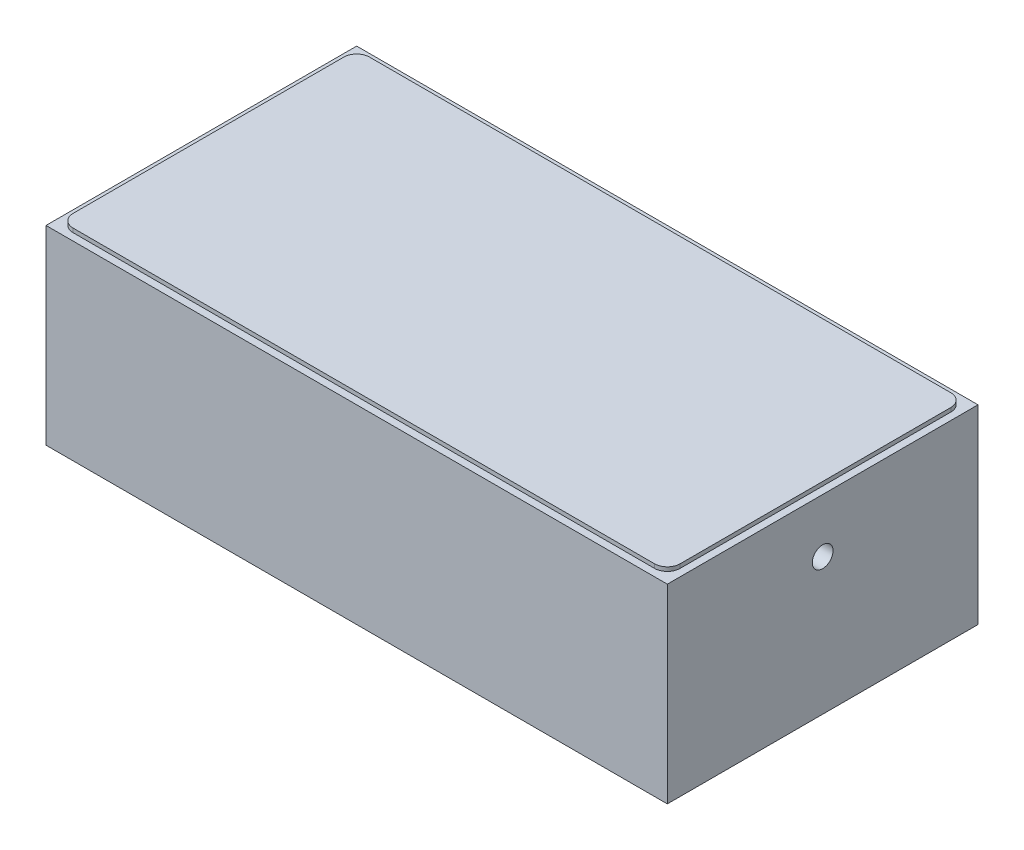
ISO-10303-21;
HEADER;
FILE_DESCRIPTION(('STEP AP214'),'2;1');
FILE_NAME('part.step','',(''),(''),'','','');
FILE_SCHEMA(('AUTOMOTIVE_DESIGN { 1 0 10303 214 1 1 1 1 }'));
ENDSEC;
DATA;
#1=APPLICATION_CONTEXT('core data for automotive mechanical design processes');
#2=APPLICATION_PROTOCOL_DEFINITION('international standard','automotive_design',2000,#1);
#3=PRODUCT_CONTEXT('',#1,'mechanical');
#4=PRODUCT('Part','Part','',(#3));
#5=PRODUCT_RELATED_PRODUCT_CATEGORY('part','',(#4));
#6=PRODUCT_DEFINITION_FORMATION('','',#4);
#7=PRODUCT_DEFINITION_CONTEXT('part definition',#1,'design');
#8=PRODUCT_DEFINITION('design','',#6,#7);
#9=PRODUCT_DEFINITION_SHAPE('','',#8);
#10=(LENGTH_UNIT() NAMED_UNIT(*) SI_UNIT(.MILLI.,.METRE.));
#11=(NAMED_UNIT(*) PLANE_ANGLE_UNIT() SI_UNIT($,.RADIAN.));
#12=(NAMED_UNIT(*) SI_UNIT($,.STERADIAN.) SOLID_ANGLE_UNIT());
#13=UNCERTAINTY_MEASURE_WITH_UNIT(LENGTH_MEASURE(1.E-05),#10,'distance_accuracy_value','');
#14=(GEOMETRIC_REPRESENTATION_CONTEXT(3) GLOBAL_UNCERTAINTY_ASSIGNED_CONTEXT((#13)) GLOBAL_UNIT_ASSIGNED_CONTEXT((#10,
#11,#12)) REPRESENTATION_CONTEXT('',''));
#15=CARTESIAN_POINT('',(0.,0.,0.));
#16=DIRECTION('',(0.,0.,1.));
#17=DIRECTION('',(1.,0.,0.));
#18=AXIS2_PLACEMENT_3D('',#15,#16,#17);
#19=CARTESIAN_POINT('',(-75.,0.,37.5));
#20=DIRECTION('',(0.,1.,0.));
#21=DIRECTION('',(0.,0.,1.));
#22=AXIS2_PLACEMENT_3D('',#19,#20,#21);
#23=PLANE('',#22);
#24=DIRECTION('',(1.,0.,0.));
#25=VECTOR('',#24,1.);
#26=CARTESIAN_POINT('',(-75.,0.,-34.452));
#27=LINE('',#26,#25);
#28=CARTESIAN_POINT('',(-71.952,0.,-34.452));
#29=VERTEX_POINT('',#28);
#30=CARTESIAN_POINT('',(71.952,0.,-34.452));
#31=VERTEX_POINT('',#30);
#32=EDGE_CURVE('E460',#29,#31,#27,.T.);
#33=ORIENTED_EDGE('',*,*,#32,.T.);
#34=DIRECTION('',(0.,0.,1.));
#35=VECTOR('',#34,1.);
#36=CARTESIAN_POINT('',(71.952,0.,37.5));
#37=LINE('',#36,#35);
#38=CARTESIAN_POINT('',(71.952,0.,34.452));
#39=VERTEX_POINT('',#38);
#40=EDGE_CURVE('E457',#31,#39,#37,.T.);
#41=ORIENTED_EDGE('',*,*,#40,.T.);
#42=DIRECTION('',(-1.,0.,0.));
#43=VECTOR('',#42,1.);
#44=CARTESIAN_POINT('',(-75.,0.,34.452));
#45=LINE('',#44,#43);
#46=CARTESIAN_POINT('',(-71.9519999999999,0.,34.452));
#47=VERTEX_POINT('',#46);
#48=EDGE_CURVE('E441',#39,#47,#45,.T.);
#49=ORIENTED_EDGE('',*,*,#48,.T.);
#50=DIRECTION('',(0.,0.,-1.));
#51=VECTOR('',#50,1.);
#52=CARTESIAN_POINT('',(-71.9519999999999,0.,37.5));
#53=LINE('',#52,#51);
#54=EDGE_CURVE('E461',#47,#29,#53,.T.);
#55=ORIENTED_EDGE('',*,*,#54,.T.);
#56=EDGE_LOOP('',(#33,#41,#49,#55));
#57=FACE_BOUND('',#56,.T.);
#58=CARTESIAN_POINT('',(-50.,0.,0.));
#59=DIRECTION('',(0.,-1.,0.));
#60=DIRECTION('',(0.,0.,-1.));
#61=AXIS2_PLACEMENT_3D('',#58,#59,#60);
#62=CIRCLE('',#61,3.175);
#63=CARTESIAN_POINT('',(-50.,0.,-3.17499999999999));
#64=VERTEX_POINT('',#63);
#65=EDGE_CURVE('E253',#64,#64,#62,.T.);
#66=ORIENTED_EDGE('',*,*,#65,.F.);
#67=EDGE_LOOP('',(#66));
#68=FACE_BOUND('',#67,.T.);
#69=CARTESIAN_POINT('',(50.,0.,0.));
#70=DIRECTION('',(0.,-1.,0.));
#71=DIRECTION('',(0.,0.,-1.));
#72=AXIS2_PLACEMENT_3D('',#69,#70,#71);
#73=CIRCLE('',#72,2.5);
#74=CARTESIAN_POINT('',(50.,0.,-2.5));
#75=VERTEX_POINT('',#74);
#76=EDGE_CURVE('E265',#75,#75,#73,.T.);
#77=ORIENTED_EDGE('',*,*,#76,.F.);
#78=EDGE_LOOP('',(#77));
#79=FACE_BOUND('',#78,.T.);
#80=CARTESIAN_POINT('',(9.52499999999985,0.,16.4977839420936));
#81=DIRECTION('',(0.,-1.,0.));
#82=DIRECTION('',(0.,0.,-1.));
#83=AXIS2_PLACEMENT_3D('',#80,#81,#82);
#84=CIRCLE('',#83,1.25);
#85=CARTESIAN_POINT('',(9.52499999999985,0.,15.2477839420936));
#86=VERTEX_POINT('',#85);
#87=EDGE_CURVE('E271',#86,#86,#84,.T.);
#88=ORIENTED_EDGE('',*,*,#87,.F.);
#89=EDGE_LOOP('',(#88));
#90=FACE_BOUND('',#89,.T.);
#91=CARTESIAN_POINT('',(9.52500000000008,0.,-16.4977839420935));
#92=DIRECTION('',(0.,-1.,0.));
#93=DIRECTION('',(0.,0.,-1.));
#94=AXIS2_PLACEMENT_3D('',#91,#92,#93);
#95=CIRCLE('',#94,1.25);
#96=CARTESIAN_POINT('',(9.52500000000008,0.,-17.7477839420935));
#97=VERTEX_POINT('',#96);
#98=EDGE_CURVE('E277',#97,#97,#95,.T.);
#99=ORIENTED_EDGE('',*,*,#98,.F.);
#100=EDGE_LOOP('',(#99));
#101=FACE_BOUND('',#100,.T.);
#102=CARTESIAN_POINT('',(-19.05,0.,0.));
#103=DIRECTION('',(0.,-1.,0.));
#104=DIRECTION('',(0.,0.,-1.));
#105=AXIS2_PLACEMENT_3D('',#102,#103,#104);
#106=CIRCLE('',#105,1.25);
#107=CARTESIAN_POINT('',(-19.05,0.,-1.25));
#108=VERTEX_POINT('',#107);
#109=EDGE_CURVE('E283',#108,#108,#106,.T.);
#110=ORIENTED_EDGE('',*,*,#109,.F.);
#111=EDGE_LOOP('',(#110));
#112=FACE_BOUND('',#111,.T.);
#113=CARTESIAN_POINT('',(0.,0.,0.));
#114=DIRECTION('',(0.,1.,0.));
#115=DIRECTION('',(0.,0.,1.));
#116=AXIS2_PLACEMENT_3D('',#113,#114,#115);
#117=CIRCLE('',#116,12.4964787936442);
#118=CARTESIAN_POINT('',(0.,0.,12.4964787936442));
#119=VERTEX_POINT('',#118);
#120=EDGE_CURVE('E286',#119,#119,#117,.F.);
#121=ORIENTED_EDGE('',*,*,#120,.F.);
#122=EDGE_LOOP('',(#121));
#123=FACE_BOUND('',#122,.T.);
#124=ADVANCED_FACE('F43',(#57,#68,#79,#90,#101,#112,#123),#23,.F.);
#125=CARTESIAN_POINT('',(-75.,48.9966,-37.5));
#126=DIRECTION('',(1.,0.,0.));
#127=DIRECTION('',(0.,0.,-1.));
#128=AXIS2_PLACEMENT_3D('',#125,#126,#127);
#129=PLANE('',#128);
#130=DIRECTION('',(0.,-1.,0.));
#131=VECTOR('',#130,1.);
#132=CARTESIAN_POINT('',(-75.,48.9966,-37.5));
#133=LINE('',#132,#131);
#134=CARTESIAN_POINT('',(-75.,48.9966,-37.5));
#135=VERTEX_POINT('',#134);
#136=CARTESIAN_POINT('',(-75.,3.04800000000001,-37.5));
#137=VERTEX_POINT('',#136);
#138=EDGE_CURVE('E296',#135,#137,#133,.T.);
#139=ORIENTED_EDGE('',*,*,#138,.T.);
#140=DIRECTION('',(0.,0.,1.));
#141=VECTOR('',#140,1.);
#142=CARTESIAN_POINT('',(-75.,3.04800000000001,-37.5));
#143=LINE('',#142,#141);
#144=CARTESIAN_POINT('',(-75.,3.04800000000001,37.5));
#145=VERTEX_POINT('',#144);
#146=EDGE_CURVE('E12',#137,#145,#143,.T.);
#147=ORIENTED_EDGE('',*,*,#146,.T.);
#148=DIRECTION('',(0.,-1.,0.));
#149=VECTOR('',#148,1.);
#150=CARTESIAN_POINT('',(-75.,48.9966,37.5));
#151=LINE('',#150,#149);
#152=CARTESIAN_POINT('',(-75.,48.9966,37.5));
#153=VERTEX_POINT('',#152);
#154=EDGE_CURVE('E305',#153,#145,#151,.T.);
#155=ORIENTED_EDGE('',*,*,#154,.F.);
#156=DIRECTION('',(0.,0.,1.));
#157=VECTOR('',#156,1.);
#158=CARTESIAN_POINT('',(-75.,48.9966,-37.5));
#159=LINE('',#158,#157);
#160=EDGE_CURVE('E287',#135,#153,#159,.T.);
#161=ORIENTED_EDGE('',*,*,#160,.F.);
#162=EDGE_LOOP('',(#139,#147,#155,#161));
#163=FACE_BOUND('',#162,.T.);
#164=ADVANCED_FACE('F400',(#163),#129,.F.);
#165=CARTESIAN_POINT('',(-75.,48.9966,37.5));
#166=DIRECTION('',(0.,0.,-1.));
#167=DIRECTION('',(-1.,0.,0.));
#168=AXIS2_PLACEMENT_3D('',#165,#166,#167);
#169=PLANE('',#168);
#170=ORIENTED_EDGE('',*,*,#154,.T.);
#171=DIRECTION('',(1.,0.,0.));
#172=VECTOR('',#171,1.);
#173=CARTESIAN_POINT('',(-75.,3.04800000000001,37.5));
#174=LINE('',#173,#172);
#175=CARTESIAN_POINT('',(75.,3.04800000000001,37.5));
#176=VERTEX_POINT('',#175);
#177=EDGE_CURVE('E443',#145,#176,#174,.T.);
#178=ORIENTED_EDGE('',*,*,#177,.T.);
#179=DIRECTION('',(0.,-1.,0.));
#180=VECTOR('',#179,1.);
#181=CARTESIAN_POINT('',(75.,48.9966,37.5));
#182=LINE('',#181,#180);
#183=CARTESIAN_POINT('',(75.,48.9966,37.5));
#184=VERTEX_POINT('',#183);
#185=EDGE_CURVE('E302',#184,#176,#182,.T.);
#186=ORIENTED_EDGE('',*,*,#185,.F.);
#187=DIRECTION('',(1.,0.,0.));
#188=VECTOR('',#187,1.);
#189=CARTESIAN_POINT('',(-75.,48.9966,37.5));
#190=LINE('',#189,#188);
#191=EDGE_CURVE('E290',#153,#184,#190,.T.);
#192=ORIENTED_EDGE('',*,*,#191,.F.);
#193=EDGE_LOOP('',(#170,#178,#186,#192));
#194=FACE_BOUND('',#193,.T.);
#195=ADVANCED_FACE('F406',(#194),#169,.F.);
#196=CARTESIAN_POINT('',(75.,48.9966,-37.5));
#197=DIRECTION('',(-1.,0.,0.));
#198=DIRECTION('',(0.,0.,1.));
#199=AXIS2_PLACEMENT_3D('',#196,#197,#198);
#200=PLANE('',#199);
#201=CARTESIAN_POINT('',(75.0000000000001,35.9918,0.));
#202=DIRECTION('',(1.,0.,0.));
#203=DIRECTION('',(0.,0.,-1.));
#204=AXIS2_PLACEMENT_3D('',#201,#202,#203);
#205=CIRCLE('',#204,2.49999999999995);
#206=CARTESIAN_POINT('',(75.0000000000001,35.9918,-2.49999999999994));
#207=VERTEX_POINT('',#206);
#208=EDGE_CURVE('E247',#207,#207,#205,.T.);
#209=ORIENTED_EDGE('',*,*,#208,.F.);
#210=EDGE_LOOP('',(#209));
#211=FACE_BOUND('',#210,.T.);
#212=ORIENTED_EDGE('',*,*,#185,.T.);
#213=DIRECTION('',(0.,0.,-1.));
#214=VECTOR('',#213,1.);
#215=CARTESIAN_POINT('',(75.,3.04800000000001,-37.5));
#216=LINE('',#215,#214);
#217=CARTESIAN_POINT('',(75.,3.04800000000001,-37.5));
#218=VERTEX_POINT('',#217);
#219=EDGE_CURVE('E308',#176,#218,#216,.T.);
#220=ORIENTED_EDGE('',*,*,#219,.T.);
#221=DIRECTION('',(0.,-1.,0.));
#222=VECTOR('',#221,1.);
#223=CARTESIAN_POINT('',(75.,48.9966,-37.5));
#224=LINE('',#223,#222);
#225=CARTESIAN_POINT('',(75.,48.9966,-37.5));
#226=VERTEX_POINT('',#225);
#227=EDGE_CURVE('E299',#226,#218,#224,.T.);
#228=ORIENTED_EDGE('',*,*,#227,.F.);
#229=DIRECTION('',(0.,0.,-1.));
#230=VECTOR('',#229,1.);
#231=CARTESIAN_POINT('',(75.,48.9966,-37.5));
#232=LINE('',#231,#230);
#233=EDGE_CURVE('E292',#184,#226,#232,.T.);
#234=ORIENTED_EDGE('',*,*,#233,.F.);
#235=EDGE_LOOP('',(#212,#220,#228,#234));
#236=FACE_BOUND('',#235,.T.);
#237=ADVANCED_FACE('F414',(#211,#236),#200,.F.);
#238=CARTESIAN_POINT('',(-75.,48.9966,-37.5));
#239=DIRECTION('',(0.,0.,1.));
#240=DIRECTION('',(1.,0.,0.));
#241=AXIS2_PLACEMENT_3D('',#238,#239,#240);
#242=PLANE('',#241);
#243=ORIENTED_EDGE('',*,*,#227,.T.);
#244=DIRECTION('',(-1.,0.,0.));
#245=VECTOR('',#244,1.);
#246=CARTESIAN_POINT('',(-75.,3.04800000000001,-37.5));
#247=LINE('',#246,#245);
#248=EDGE_CURVE('E52',#218,#137,#247,.T.);
#249=ORIENTED_EDGE('',*,*,#248,.T.);
#250=ORIENTED_EDGE('',*,*,#138,.F.);
#251=DIRECTION('',(-1.,0.,0.));
#252=VECTOR('',#251,1.);
#253=CARTESIAN_POINT('',(-75.,48.9966,-37.5));
#254=LINE('',#253,#252);
#255=EDGE_CURVE('E294',#226,#135,#254,.T.);
#256=ORIENTED_EDGE('',*,*,#255,.F.);
#257=EDGE_LOOP('',(#243,#249,#250,#256));
#258=FACE_BOUND('',#257,.T.);
#259=ADVANCED_FACE('F411',(#258),#242,.F.);
#260=CARTESIAN_POINT('',(-75.,48.9966,37.5));
#261=DIRECTION('',(0.,1.,0.));
#262=DIRECTION('',(0.,0.,1.));
#263=AXIS2_PLACEMENT_3D('',#260,#261,#262);
#264=PLANE('',#263);
#265=CARTESIAN_POINT('',(70.1613,48.9966,32.6613));
#266=DIRECTION('',(0.,-1.,0.));
#267=DIRECTION('',(0.,0.,1.));
#268=AXIS2_PLACEMENT_3D('',#265,#266,#267);
#269=CIRCLE('',#268,3.08609999999999);
#270=CARTESIAN_POINT('',(73.2474,48.9966,32.6613));
#271=VERTEX_POINT('',#270);
#272=CARTESIAN_POINT('',(70.1613,48.9966,35.7474));
#273=VERTEX_POINT('',#272);
#274=EDGE_CURVE('E205',#271,#273,#269,.T.);
#275=ORIENTED_EDGE('',*,*,#274,.T.);
#276=DIRECTION('',(-1.,0.,0.));
#277=VECTOR('',#276,1.);
#278=CARTESIAN_POINT('',(70.1613,48.9966,35.7474));
#279=LINE('',#278,#277);
#280=CARTESIAN_POINT('',(-70.1991,48.9966,35.7474));
#281=VERTEX_POINT('',#280);
#282=EDGE_CURVE('E168',#273,#281,#279,.T.);
#283=ORIENTED_EDGE('',*,*,#282,.T.);
#284=CARTESIAN_POINT('',(-70.1991,48.9966,32.6613));
#285=DIRECTION('',(0.,-1.,0.));
#286=DIRECTION('',(0.,0.,1.));
#287=AXIS2_PLACEMENT_3D('',#284,#285,#286);
#288=CIRCLE('',#287,3.0861);
#289=CARTESIAN_POINT('',(-73.2852,48.9966,32.6613));
#290=VERTEX_POINT('',#289);
#291=EDGE_CURVE('E208',#281,#290,#288,.T.);
#292=ORIENTED_EDGE('',*,*,#291,.T.);
#293=DIRECTION('',(0.,0.,-1.));
#294=VECTOR('',#293,1.);
#295=CARTESIAN_POINT('',(-73.2852,48.9966,32.6613));
#296=LINE('',#295,#294);
#297=CARTESIAN_POINT('',(-73.2852,48.9966,-32.6929));
#298=VERTEX_POINT('',#297);
#299=EDGE_CURVE('E210',#290,#298,#296,.T.);
#300=ORIENTED_EDGE('',*,*,#299,.T.);
#301=CARTESIAN_POINT('',(-70.1991,48.9966,-32.6929));
#302=DIRECTION('',(0.,-1.,0.));
#303=DIRECTION('',(0.,0.,1.));
#304=AXIS2_PLACEMENT_3D('',#301,#302,#303);
#305=CIRCLE('',#304,3.0861);
#306=CARTESIAN_POINT('',(-70.1991,48.9966,-35.779));
#307=VERTEX_POINT('',#306);
#308=EDGE_CURVE('E212',#298,#307,#305,.T.);
#309=ORIENTED_EDGE('',*,*,#308,.T.);
#310=DIRECTION('',(1.,0.,0.));
#311=VECTOR('',#310,1.);
#312=CARTESIAN_POINT('',(70.1613,48.9966,-35.779));
#313=LINE('',#312,#311);
#314=CARTESIAN_POINT('',(70.1613,48.9966,-35.779));
#315=VERTEX_POINT('',#314);
#316=EDGE_CURVE('E214',#307,#315,#313,.T.);
#317=ORIENTED_EDGE('',*,*,#316,.T.);
#318=CARTESIAN_POINT('',(70.1613,48.9966,-32.6929));
#319=DIRECTION('',(0.,-1.,0.));
#320=DIRECTION('',(0.,0.,1.));
#321=AXIS2_PLACEMENT_3D('',#318,#319,#320);
#322=CIRCLE('',#321,3.08609999999999);
#323=CARTESIAN_POINT('',(73.2474,48.9966,-32.6929));
#324=VERTEX_POINT('',#323);
#325=EDGE_CURVE('E65',#315,#324,#322,.T.);
#326=ORIENTED_EDGE('',*,*,#325,.T.);
#327=DIRECTION('',(0.,0.,1.));
#328=VECTOR('',#327,1.);
#329=CARTESIAN_POINT('',(73.2474,48.9966,32.6613));
#330=LINE('',#329,#328);
#331=EDGE_CURVE('E60',#324,#271,#330,.T.);
#332=ORIENTED_EDGE('',*,*,#331,.T.);
#333=EDGE_LOOP('',(#275,#283,#292,#300,#309,#317,#326,#332));
#334=FACE_BOUND('',#333,.T.);
#335=ORIENTED_EDGE('',*,*,#160,.T.);
#336=ORIENTED_EDGE('',*,*,#191,.T.);
#337=ORIENTED_EDGE('',*,*,#233,.T.);
#338=ORIENTED_EDGE('',*,*,#255,.T.);
#339=EDGE_LOOP('',(#335,#336,#337,#338));
#340=FACE_BOUND('',#339,.T.);
#341=ADVANCED_FACE('F395',(#334,#340),#264,.T.);
#342=CARTESIAN_POINT('',(0.,-0.508,0.));
#343=DIRECTION('',(0.,-1.,0.));
#344=DIRECTION('',(-1.,0.,0.));
#345=AXIS2_PLACEMENT_3D('',#342,#343,#344);
#346=SPHERICAL_SURFACE('',#345,12.5068);
#347=CARTESIAN_POINT('',(-1.67710806418912,11.768687506074,-1.70008783868312));
#348=CARTESIAN_POINT('',(-1.58249668516484,11.7685180426151,-1.79463579522802));
#349=CARTESIAN_POINT('',(-1.47983180253442,11.7683547029005,-1.88126276938554));
#350=CARTESIAN_POINT('',(-1.26132841257828,11.7680450407868,-2.03612060905985));
#351=CARTESIAN_POINT('',(-1.1454741881304,11.76789873912,-2.10432919302961));
#352=CARTESIAN_POINT('',(-0.904001803127493,11.7676275201763,-2.22029697257091));
#353=CARTESIAN_POINT('',(-0.778388328744952,11.7675025927273,-2.26806591196617));
#354=CARTESIAN_POINT('',(-0.520958753567253,11.7672776369512,-2.34182261560498));
#355=CARTESIAN_POINT('',(-0.389144201810428,11.7671776024446,-2.3678157892733));
#356=CARTESIAN_POINT('',(-0.123007562225725,11.7670052185041,-2.39730844715314));
#357=CARTESIAN_POINT('',(0.0113147848729525,11.7669328719494,-2.40080559253129));
#358=CARTESIAN_POINT('',(0.278645225315112,11.7668179322071,-2.3851993850443));
#359=CARTESIAN_POINT('',(0.411653266856857,11.7667753401876,-2.36609514492775));
#360=CARTESIAN_POINT('',(0.672571546474357,11.7667211255071,-2.30582788472627));
#361=CARTESIAN_POINT('',(0.800481883430208,11.7667095022451,-2.2646652927308));
#362=CARTESIAN_POINT('',(1.04757618253433,11.7667175525551,-2.16145012024242));
#363=CARTESIAN_POINT('',(1.16676016225211,11.7667372260641,-2.09939758181038));
#364=CARTESIAN_POINT('',(1.39301895023694,11.7668073119338,-1.95616388759442));
#365=CARTESIAN_POINT('',(1.50009373895603,11.7668577243441,-1.87498270093162));
#366=CARTESIAN_POINT('',(1.69909419940792,11.7669878547134,-1.6957964250661));
#367=CARTESIAN_POINT('',(1.791019898425,11.7670675726197,-1.5977913661647));
#368=CARTESIAN_POINT('',(1.95711298694153,11.7672540505237,-1.38773924561192));
#369=CARTESIAN_POINT('',(2.03128036403905,11.7673608105403,-1.27569217415408));
#370=CARTESIAN_POINT('',(2.15975141286497,11.7675983390902,-1.04073664285778));
#371=CARTESIAN_POINT('',(2.21405506354784,11.7677291076489,-0.917828171511885));
#372=CARTESIAN_POINT('',(2.30125706074846,11.7680109400719,-0.664638892702607));
#373=CARTESIAN_POINT('',(2.33415539710925,11.7681620039459,-0.534358081741029));
#374=CARTESIAN_POINT('',(2.37761284008724,11.7684801355508,-0.270122517852876));
#375=CARTESIAN_POINT('',(2.3881719556316,11.7686472032753,-0.136167766394495));
#376=CARTESIAN_POINT('',(2.38665124995693,11.7689925996583,0.131613299700255));
#377=CARTESIAN_POINT('',(2.37457140472076,11.7691709283288,0.265439614200219));
#378=CARTESIAN_POINT('',(2.32811564375585,11.7695337820397,0.529164750888992));
#379=CARTESIAN_POINT('',(2.29373972501968,11.769718307081,0.659063572548036));
#380=CARTESIAN_POINT('',(2.20366761931299,11.7700883160866,0.911246341049468));
#381=CARTESIAN_POINT('',(2.14797141955239,11.7702738000515,1.03353028332362));
#382=CARTESIAN_POINT('',(2.01683980602344,11.7706404606059,1.26701192154122));
#383=CARTESIAN_POINT('',(1.94140439311678,11.7708216371957,1.3782096179686));
#384=CARTESIAN_POINT('',(1.77293573082957,11.7711745419286,1.58636220098907));
#385=CARTESIAN_POINT('',(1.67990248004064,11.7713462700711,1.68331708644227));
#386=CARTESIAN_POINT('',(1.47887907799872,11.7716754034683,1.86023176937196));
#387=CARTESIAN_POINT('',(1.37088892610197,11.7718328087223,1.94019156611697));
#388=CARTESIAN_POINT('',(1.14301730093828,11.7721288309516,2.08084619786821));
#389=CARTESIAN_POINT('',(1.0231358333159,11.7722674479357,2.14154104201905));
#390=CARTESIAN_POINT('',(0.774884632859043,11.7725219597958,2.24194285308161));
#391=CARTESIAN_POINT('',(0.646514901172433,11.7726378546748,2.2816498228315));
#392=CARTESIAN_POINT('',(0.384931337080366,11.7728436354426,2.33894869123718));
#393=CARTESIAN_POINT('',(0.251717509640812,11.7729335213579,2.35654061256346));
#394=CARTESIAN_POINT('',(-0.0157728728876299,11.7730847335095,2.36911006880482));
#395=CARTESIAN_POINT('',(-0.150049428401268,11.7731460597344,2.36408759468095));
#396=CARTESIAN_POINT('',(-0.415853414756421,11.7732384139278,2.3315708149679));
#397=CARTESIAN_POINT('',(-0.547380847093663,11.7732694419128,2.3040765216054));
#398=CARTESIAN_POINT('',(-0.803952841308594,11.7733003185053,2.22739663988531));
#399=CARTESIAN_POINT('',(-0.928997410051708,11.7733001671457,2.17821107449956));
#400=CARTESIAN_POINT('',(-1.16905407791403,11.773268690507,2.05954493864145));
#401=CARTESIAN_POINT('',(-1.28406618549334,11.7732373652542,1.99006438528352));
#402=CARTESIAN_POINT('',(-1.50079339705373,11.773144428236,1.83278046162358));
#403=CARTESIAN_POINT('',(-1.60250847707683,11.773082816416,1.74497705830902));
#404=CARTESIAN_POINT('',(-1.78975383557864,11.7729310550989,1.55354017488016));
#405=CARTESIAN_POINT('',(-1.87528414272505,11.7728409056522,1.44990672280583));
#406=CARTESIAN_POINT('',(-2.02773237821915,11.7726346250603,1.2297512356919));
#407=CARTESIAN_POINT('',(-2.0946502690821,11.7725184938627,1.11322917469576));
#408=CARTESIAN_POINT('',(-2.20797500428808,11.7722635431987,0.870602079449783));
#409=CARTESIAN_POINT('',(-2.2543814526068,11.7721247232943,0.744496860228367));
#410=CARTESIAN_POINT('',(-2.32536241734707,11.7718283396727,0.486290135782088));
#411=CARTESIAN_POINT('',(-2.34993779073146,11.7716707766915,0.354188866141769));
#412=CARTESIAN_POINT('',(-2.37656156289771,11.7713413931321,0.0877501144740379));
#413=CARTESIAN_POINT('',(-2.37861229749473,11.7711695740341,-0.0465871342343399));
#414=CARTESIAN_POINT('',(-2.36012941331434,11.770816488047,-0.313735687386931));
#415=CARTESIAN_POINT('',(-2.33959018098367,11.7706352188202,-0.446546604252699));
#416=CARTESIAN_POINT('',(-2.27649739829504,11.7702683531801,-0.706886266698238));
#417=CARTESIAN_POINT('',(-2.23393332361002,11.7700827547386,-0.83441245553611));
#418=CARTESIAN_POINT('',(-2.12801722051628,11.7697127258483,-1.08039322615576));
#419=CARTESIAN_POINT('',(-2.06469026024019,11.769528294263,-1.19885853594695));
#420=CARTESIAN_POINT('',(-1.94647454681102,11.7692338893507,-1.38123680370126));
#421=CARTESIAN_POINT('',(-1.89733066456494,11.7691219361562,-1.44894433262643));
#422=CARTESIAN_POINT('',(-1.79220884771791,11.7689016935531,-1.578828242076));
#423=CARTESIAN_POINT('',(-1.73623091311425,11.7687934041444,-1.64100462259821));
#424=CARTESIAN_POINT('',(-1.67710806418912,11.768687506074,-1.70008783868312));
#425=B_SPLINE_CURVE_WITH_KNOTS('',3,(#347,#348,#349,#350,#351,#352,#353,#354,#355,#356,#357,
#358,#359,#360,#361,#362,#363,#364,#365,#366,#367,#368,#369,#370,#371,#372,#373,#374,#375,#376,
#377,#378,#379,#380,#381,#382,#383,#384,#385,#386,#387,#388,#389,#390,#391,#392,#393,#394,#395,
#396,#397,#398,#399,#400,#401,#402,#403,#404,#405,#406,#407,#408,#409,#410,#411,#412,#413,#414,
#415,#416,#417,#418,#419,#420,#421,#422,#423,#424),.UNSPECIFIED.,.T.,.F.,(4,2,2,2,2,2,2,2,2,2,2,
2,2,2,2,2,2,2,2,2,2,2,2,2,2,2,2,2,2,2,2,2,2,2,2,2,2,2,4),(0.,0.400962808507392,
0.802408528312621,1.20366266033774,1.60481708527409,2.00601321615885,2.40722509712436,
2.80842919199775,3.20963247907123,3.61083641380097,4.01203962593387,4.4132431182551,
4.81444703564836,5.2156511434154,5.61685509085397,6.01805946392083,6.41926389110447,
6.82046855897185,7.22167320932534,7.62287789178767,8.02408259151781,8.42528710080545,
8.82649155583885,9.22769559959102,9.62889980370427,10.0301037895269,10.4313073504613,
10.8325105730684,11.2337145185354,11.6349177533533,12.0361217961744,12.4373335848972,
12.8385296236495,13.2396840577996,13.6409382004036,14.0423842551568,14.4433473967258,
14.6939098955189,14.9444723944113),.UNSPECIFIED.);
#426=CARTESIAN_POINT('',(-1.67710806418912,11.768687506074,-1.70008783868312));
#427=VERTEX_POINT('',#426);
#428=EDGE_CURVE('E237',#427,#427,#425,.T.);
#429=ORIENTED_EDGE('',*,*,#428,.F.);
#430=EDGE_LOOP('',(#429));
#431=FACE_BOUND('',#430,.T.);
#432=ORIENTED_EDGE('',*,*,#120,.T.);
#433=EDGE_LOOP('',(#432));
#434=FACE_BOUND('',#433,.T.);
#435=ADVANCED_FACE('F318',(#431,#434),#346,.F.);
#436=CARTESIAN_POINT('',(-19.05,0.,0.));
#437=DIRECTION('',(0.,-1.,0.));
#438=DIRECTION('',(0.,0.,-1.));
#439=AXIS2_PLACEMENT_3D('',#436,#437,#438);
#440=CYLINDRICAL_SURFACE('',#439,1.25);
#441=CARTESIAN_POINT('',(-19.05,7.849997,0.));
#442=DIRECTION('',(0.,-1.,0.));
#443=DIRECTION('',(0.,0.,-1.));
#444=AXIS2_PLACEMENT_3D('',#441,#442,#443);
#445=CIRCLE('',#444,1.25);
#446=CARTESIAN_POINT('',(-19.05,7.849997,-1.25));
#447=VERTEX_POINT('',#446);
#448=EDGE_CURVE('E280',#447,#447,#445,.T.);
#449=ORIENTED_EDGE('',*,*,#448,.F.);
#450=EDGE_LOOP('',(#449));
#451=FACE_BOUND('',#450,.T.);
#452=ORIENTED_EDGE('',*,*,#109,.T.);
#453=EDGE_LOOP('',(#452));
#454=FACE_BOUND('',#453,.T.);
#455=ADVANCED_FACE('F388',(#451,#454),#440,.F.);
#456=CARTESIAN_POINT('',(-19.05,7.849997,0.));
#457=DIRECTION('',(0.,-1.,0.));
#458=DIRECTION('',(0.,0.,-1.));
#459=AXIS2_PLACEMENT_3D('',#456,#457,#458);
#460=CONICAL_SURFACE('',#459,1.25,1.0471975511966);
#461=CARTESIAN_POINT('',(-19.05,8.57168483648703,0.));
#462=VERTEX_POINT('',#461);
#463=VERTEX_LOOP('',#462);
#464=FACE_BOUND('',#463,.T.);
#465=ORIENTED_EDGE('',*,*,#448,.T.);
#466=EDGE_LOOP('',(#465));
#467=FACE_BOUND('',#466,.T.);
#468=ADVANCED_FACE('F385',(#464,#467),#460,.F.);
#469=CARTESIAN_POINT('',(9.52500000000008,0.,-16.4977839420935));
#470=DIRECTION('',(0.,-1.,0.));
#471=DIRECTION('',(0.,0.,-1.));
#472=AXIS2_PLACEMENT_3D('',#469,#470,#471);
#473=CYLINDRICAL_SURFACE('',#472,1.25);
#474=CARTESIAN_POINT('',(9.52500000000008,7.849997,-16.4977839420935));
#475=DIRECTION('',(0.,-1.,0.));
#476=DIRECTION('',(0.,0.,-1.));
#477=AXIS2_PLACEMENT_3D('',#474,#475,#476);
#478=CIRCLE('',#477,1.25);
#479=CARTESIAN_POINT('',(9.52500000000008,7.849997,-17.7477839420935));
#480=VERTEX_POINT('',#479);
#481=EDGE_CURVE('E274',#480,#480,#478,.T.);
#482=ORIENTED_EDGE('',*,*,#481,.F.);
#483=EDGE_LOOP('',(#482));
#484=FACE_BOUND('',#483,.T.);
#485=ORIENTED_EDGE('',*,*,#98,.T.);
#486=EDGE_LOOP('',(#485));
#487=FACE_BOUND('',#486,.T.);
#488=ADVANCED_FACE('F381',(#484,#487),#473,.F.);
#489=CARTESIAN_POINT('',(9.52500000000008,7.849997,-16.4977839420935));
#490=DIRECTION('',(0.,-1.,0.));
#491=DIRECTION('',(0.,0.,-1.));
#492=AXIS2_PLACEMENT_3D('',#489,#490,#491);
#493=CONICAL_SURFACE('',#492,1.25,1.0471975511966);
#494=CARTESIAN_POINT('',(9.52500000000008,8.57168483648703,-16.4977839420935));
#495=VERTEX_POINT('',#494);
#496=VERTEX_LOOP('',#495);
#497=FACE_BOUND('',#496,.T.);
#498=ORIENTED_EDGE('',*,*,#481,.T.);
#499=EDGE_LOOP('',(#498));
#500=FACE_BOUND('',#499,.T.);
#501=ADVANCED_FACE('F377',(#497,#500),#493,.F.);
#502=CARTESIAN_POINT('',(9.52499999999985,0.,16.4977839420936));
#503=DIRECTION('',(0.,-1.,0.));
#504=DIRECTION('',(0.,0.,-1.));
#505=AXIS2_PLACEMENT_3D('',#502,#503,#504);
#506=CYLINDRICAL_SURFACE('',#505,1.25);
#507=CARTESIAN_POINT('',(9.52499999999985,7.849997,16.4977839420936));
#508=DIRECTION('',(0.,-1.,0.));
#509=DIRECTION('',(0.,0.,-1.));
#510=AXIS2_PLACEMENT_3D('',#507,#508,#509);
#511=CIRCLE('',#510,1.25);
#512=CARTESIAN_POINT('',(9.52499999999985,7.849997,15.2477839420936));
#513=VERTEX_POINT('',#512);
#514=EDGE_CURVE('E268',#513,#513,#511,.T.);
#515=ORIENTED_EDGE('',*,*,#514,.F.);
#516=EDGE_LOOP('',(#515));
#517=FACE_BOUND('',#516,.T.);
#518=ORIENTED_EDGE('',*,*,#87,.T.);
#519=EDGE_LOOP('',(#518));
#520=FACE_BOUND('',#519,.T.);
#521=ADVANCED_FACE('F373',(#517,#520),#506,.F.);
#522=CARTESIAN_POINT('',(9.52499999999985,7.849997,16.4977839420936));
#523=DIRECTION('',(0.,-1.,0.));
#524=DIRECTION('',(0.,0.,-1.));
#525=AXIS2_PLACEMENT_3D('',#522,#523,#524);
#526=CONICAL_SURFACE('',#525,1.25,1.0471975511966);
#527=CARTESIAN_POINT('',(9.52499999999985,8.57168483648703,16.4977839420936));
#528=VERTEX_POINT('',#527);
#529=VERTEX_LOOP('',#528);
#530=FACE_BOUND('',#529,.T.);
#531=ORIENTED_EDGE('',*,*,#514,.T.);
#532=EDGE_LOOP('',(#531));
#533=FACE_BOUND('',#532,.T.);
#534=ADVANCED_FACE('F369',(#530,#533),#526,.F.);
#535=CARTESIAN_POINT('',(50.,0.,0.));
#536=DIRECTION('',(0.,-1.,0.));
#537=DIRECTION('',(0.,0.,-1.));
#538=AXIS2_PLACEMENT_3D('',#535,#536,#537);
#539=CYLINDRICAL_SURFACE('',#538,2.5);
#540=CARTESIAN_POINT('',(50.,10.16,0.));
#541=DIRECTION('',(0.,-1.,0.));
#542=DIRECTION('',(0.,0.,-1.));
#543=AXIS2_PLACEMENT_3D('',#540,#541,#542);
#544=CIRCLE('',#543,2.5);
#545=CARTESIAN_POINT('',(50.,10.16,-2.49999999999999));
#546=VERTEX_POINT('',#545);
#547=EDGE_CURVE('E262',#546,#546,#544,.T.);
#548=ORIENTED_EDGE('',*,*,#547,.F.);
#549=EDGE_LOOP('',(#548));
#550=FACE_BOUND('',#549,.T.);
#551=ORIENTED_EDGE('',*,*,#76,.T.);
#552=EDGE_LOOP('',(#551));
#553=FACE_BOUND('',#552,.T.);
#554=ADVANCED_FACE('F365',(#550,#553),#539,.F.);
#555=CARTESIAN_POINT('',(52.1,10.16,0.));
#556=DIRECTION('',(0.,1.,0.));
#557=DIRECTION('',(0.,0.,1.));
#558=AXIS2_PLACEMENT_3D('',#555,#556,#557);
#559=PLANE('',#558);
#560=CARTESIAN_POINT('',(50.,10.16,0.));
#561=DIRECTION('',(0.,-1.,0.));
#562=DIRECTION('',(0.,0.,-1.));
#563=AXIS2_PLACEMENT_3D('',#560,#561,#562);
#564=CIRCLE('',#563,2.1);
#565=CARTESIAN_POINT('',(50.,10.16,-2.09999999999999));
#566=VERTEX_POINT('',#565);
#567=EDGE_CURVE('E259',#566,#566,#564,.T.);
#568=ORIENTED_EDGE('',*,*,#567,.F.);
#569=EDGE_LOOP('',(#568));
#570=FACE_BOUND('',#569,.T.);
#571=ORIENTED_EDGE('',*,*,#547,.T.);
#572=EDGE_LOOP('',(#571));
#573=FACE_BOUND('',#572,.T.);
#574=ADVANCED_FACE('F361',(#570,#573),#559,.F.);
#575=CARTESIAN_POINT('',(50.,0.,0.));
#576=DIRECTION('',(0.,-1.,0.));
#577=DIRECTION('',(0.,0.,-1.));
#578=AXIS2_PLACEMENT_3D('',#575,#576,#577);
#579=CYLINDRICAL_SURFACE('',#578,2.1);
#580=CARTESIAN_POINT('',(50.,15.24,0.));
#581=DIRECTION('',(0.,-1.,0.));
#582=DIRECTION('',(0.,0.,-1.));
#583=AXIS2_PLACEMENT_3D('',#580,#581,#582);
#584=CIRCLE('',#583,2.1);
#585=CARTESIAN_POINT('',(50.,15.24,-2.09999999999999));
#586=VERTEX_POINT('',#585);
#587=EDGE_CURVE('E256',#586,#586,#584,.T.);
#588=ORIENTED_EDGE('',*,*,#587,.F.);
#589=EDGE_LOOP('',(#588));
#590=FACE_BOUND('',#589,.T.);
#591=ORIENTED_EDGE('',*,*,#567,.T.);
#592=EDGE_LOOP('',(#591));
#593=FACE_BOUND('',#592,.T.);
#594=ADVANCED_FACE('F357',(#590,#593),#579,.F.);
#595=CARTESIAN_POINT('',(50.,15.24,0.));
#596=DIRECTION('',(0.,-1.,0.));
#597=DIRECTION('',(0.,0.,-1.));
#598=AXIS2_PLACEMENT_3D('',#595,#596,#597);
#599=CONICAL_SURFACE('',#598,2.1,1.02974425867665);
#600=CARTESIAN_POINT('',(50.,16.5018072999579,0.));
#601=VERTEX_POINT('',#600);
#602=VERTEX_LOOP('',#601);
#603=FACE_BOUND('',#602,.T.);
#604=ORIENTED_EDGE('',*,*,#587,.T.);
#605=EDGE_LOOP('',(#604));
#606=FACE_BOUND('',#605,.T.);
#607=ADVANCED_FACE('F353',(#603,#606),#599,.F.);
#608=CARTESIAN_POINT('',(-50.,0.,0.));
#609=DIRECTION('',(0.,-1.,0.));
#610=DIRECTION('',(0.,0.,-1.));
#611=AXIS2_PLACEMENT_3D('',#608,#609,#610);
#612=CYLINDRICAL_SURFACE('',#611,3.17499999999999);
#613=CARTESIAN_POINT('',(-50.,9.652,0.));
#614=DIRECTION('',(0.,-1.,0.));
#615=DIRECTION('',(0.,0.,-1.));
#616=AXIS2_PLACEMENT_3D('',#613,#614,#615);
#617=CIRCLE('',#616,3.17499999999999);
#618=CARTESIAN_POINT('',(-50.,9.652,-3.17499999999998));
#619=VERTEX_POINT('',#618);
#620=EDGE_CURVE('E250',#619,#619,#617,.T.);
#621=ORIENTED_EDGE('',*,*,#620,.F.);
#622=EDGE_LOOP('',(#621));
#623=FACE_BOUND('',#622,.T.);
#624=ORIENTED_EDGE('',*,*,#65,.T.);
#625=EDGE_LOOP('',(#624));
#626=FACE_BOUND('',#625,.T.);
#627=ADVANCED_FACE('F349',(#623,#626),#612,.F.);
#628=CARTESIAN_POINT('',(-50.,9.652,0.));
#629=DIRECTION('',(0.,-1.,0.));
#630=DIRECTION('',(0.,0.,-1.));
#631=AXIS2_PLACEMENT_3D('',#628,#629,#630);
#632=CONICAL_SURFACE('',#631,3.17499999999999,1.02974425867665);
#633=CARTESIAN_POINT('',(-50.,11.5597324654125,0.));
#634=VERTEX_POINT('',#633);
#635=VERTEX_LOOP('',#634);
#636=FACE_BOUND('',#635,.T.);
#637=ORIENTED_EDGE('',*,*,#620,.T.);
#638=EDGE_LOOP('',(#637));
#639=FACE_BOUND('',#638,.T.);
#640=ADVANCED_FACE('F345',(#636,#639),#632,.F.);
#641=CARTESIAN_POINT('',(75.,35.9918,0.));
#642=DIRECTION('',(1.,0.,0.));
#643=DIRECTION('',(0.,0.,-1.));
#644=AXIS2_PLACEMENT_3D('',#641,#642,#643);
#645=CYLINDRICAL_SURFACE('',#644,2.49999999999995);
#646=CARTESIAN_POINT('',(64.8400000000001,35.9918,0.));
#647=DIRECTION('',(1.,0.,0.));
#648=DIRECTION('',(0.,0.,-1.));
#649=AXIS2_PLACEMENT_3D('',#646,#647,#648);
#650=CIRCLE('',#649,2.49999999999995);
#651=CARTESIAN_POINT('',(64.8400000000001,35.9918,-2.49999999999994));
#652=VERTEX_POINT('',#651);
#653=EDGE_CURVE('E244',#652,#652,#650,.T.);
#654=ORIENTED_EDGE('',*,*,#653,.F.);
#655=EDGE_LOOP('',(#654));
#656=FACE_BOUND('',#655,.T.);
#657=ORIENTED_EDGE('',*,*,#208,.T.);
#658=EDGE_LOOP('',(#657));
#659=FACE_BOUND('',#658,.T.);
#660=ADVANCED_FACE('F341',(#656,#659),#645,.F.);
#661=CARTESIAN_POINT('',(64.8400000000001,38.0918,0.));
#662=DIRECTION('',(-1.,0.,0.));
#663=DIRECTION('',(0.,0.,1.));
#664=AXIS2_PLACEMENT_3D('',#661,#662,#663);
#665=PLANE('',#664);
#666=CARTESIAN_POINT('',(64.84,35.9918,0.));
#667=DIRECTION('',(1.,0.,0.));
#668=DIRECTION('',(0.,0.,-1.));
#669=AXIS2_PLACEMENT_3D('',#666,#667,#668);
#670=CIRCLE('',#669,2.1);
#671=CARTESIAN_POINT('',(64.84,35.9918,-2.09999999999999));
#672=VERTEX_POINT('',#671);
#673=EDGE_CURVE('E241',#672,#672,#670,.T.);
#674=ORIENTED_EDGE('',*,*,#673,.F.);
#675=EDGE_LOOP('',(#674));
#676=FACE_BOUND('',#675,.T.);
#677=ORIENTED_EDGE('',*,*,#653,.T.);
#678=EDGE_LOOP('',(#677));
#679=FACE_BOUND('',#678,.T.);
#680=ADVANCED_FACE('F337',(#676,#679),#665,.F.);
#681=CARTESIAN_POINT('',(75.,35.9918,0.));
#682=DIRECTION('',(1.,0.,0.));
#683=DIRECTION('',(0.,0.,-1.));
#684=AXIS2_PLACEMENT_3D('',#681,#682,#683);
#685=CYLINDRICAL_SURFACE('',#684,2.1);
#686=CARTESIAN_POINT('',(59.76,35.9918,0.));
#687=DIRECTION('',(1.,0.,0.));
#688=DIRECTION('',(0.,0.,-1.));
#689=AXIS2_PLACEMENT_3D('',#686,#687,#688);
#690=CIRCLE('',#689,2.1);
#691=CARTESIAN_POINT('',(59.76,35.9918,-2.09999999999999));
#692=VERTEX_POINT('',#691);
#693=EDGE_CURVE('E238',#692,#692,#690,.T.);
#694=ORIENTED_EDGE('',*,*,#693,.F.);
#695=EDGE_LOOP('',(#694));
#696=FACE_BOUND('',#695,.T.);
#697=ORIENTED_EDGE('',*,*,#673,.T.);
#698=EDGE_LOOP('',(#697));
#699=FACE_BOUND('',#698,.T.);
#700=ADVANCED_FACE('F333',(#696,#699),#685,.F.);
#701=CARTESIAN_POINT('',(59.76,35.9918,0.));
#702=DIRECTION('',(1.,0.,0.));
#703=DIRECTION('',(0.,0.,-1.));
#704=AXIS2_PLACEMENT_3D('',#701,#702,#703);
#705=CONICAL_SURFACE('',#704,2.1,1.02974425867665);
#706=CARTESIAN_POINT('',(58.4981927000421,35.9918,0.));
#707=VERTEX_POINT('',#706);
#708=VERTEX_LOOP('',#707);
#709=FACE_BOUND('',#708,.T.);
#710=ORIENTED_EDGE('',*,*,#693,.T.);
#711=EDGE_LOOP('',(#710));
#712=FACE_BOUND('',#711,.T.);
#713=ADVANCED_FACE('F328',(#709,#712),#705,.F.);
#714=CARTESIAN_POINT('',(0.00619999999999787,0.,-0.0157999999999964));
#715=DIRECTION('',(0.,-1.,0.));
#716=DIRECTION('',(0.,0.,-1.));
#717=AXIS2_PLACEMENT_3D('',#714,#715,#716);
#718=CYLINDRICAL_SURFACE('',#717,2.38125);
#719=ORIENTED_EDGE('',*,*,#428,.T.);
#720=EDGE_LOOP('',(#719));
#721=FACE_BOUND('',#720,.T.);
#722=CARTESIAN_POINT('',(0.00619999999999787,12.446,-0.0157999999999964));
#723=DIRECTION('',(0.,-1.,0.));
#724=DIRECTION('',(0.,0.,-1.));
#725=AXIS2_PLACEMENT_3D('',#722,#723,#724);
#726=CIRCLE('',#725,2.38125);
#727=CARTESIAN_POINT('',(0.00619999999999787,12.446,-2.39704999999999));
#728=VERTEX_POINT('',#727);
#729=EDGE_CURVE('E234',#728,#728,#726,.T.);
#730=ORIENTED_EDGE('',*,*,#729,.F.);
#731=EDGE_LOOP('',(#730));
#732=FACE_BOUND('',#731,.T.);
#733=ADVANCED_FACE('F322',(#721,#732),#718,.F.);
#734=CARTESIAN_POINT('',(0.00619999999999483,12.446,-0.0157999999999964));
#735=DIRECTION('',(0.,1.,0.));
#736=DIRECTION('',(0.,0.,1.));
#737=AXIS2_PLACEMENT_3D('',#734,#735,#736);
#738=PLANE('',#737);
#739=ORIENTED_EDGE('',*,*,#729,.T.);
#740=EDGE_LOOP('',(#739));
#741=FACE_BOUND('',#740,.T.);
#742=ADVANCED_FACE('F327',(#741),#738,.F.);
#743=CARTESIAN_POINT('',(-75.,3.04800000000001,-37.5));
#744=DIRECTION('',(0.707106781186544,0.707106781186551,0.));
#745=DIRECTION('',(-0.707106781186551,0.707106781186544,0.));
#746=AXIS2_PLACEMENT_3D('',#743,#744,#745);
#747=PLANE('',#746);
#748=DIRECTION('',(0.577350269189629,-0.577350269189623,0.577350269189626));
#749=VECTOR('',#748,1.);
#750=CARTESIAN_POINT('',(-75.,3.04800000000001,-37.5));
#751=LINE('',#750,#749);
#752=EDGE_CURVE('E446',#29,#137,#751,.F.);
#753=ORIENTED_EDGE('',*,*,#752,.F.);
#754=ORIENTED_EDGE('',*,*,#54,.F.);
#755=DIRECTION('',(-0.577350269189628,0.577350269189623,0.577350269189626));
#756=VECTOR('',#755,1.);
#757=CARTESIAN_POINT('',(-49.9999999999999,-21.9519999999999,12.5));
#758=LINE('',#757,#756);
#759=EDGE_CURVE('E47',#145,#47,#758,.F.);
#760=ORIENTED_EDGE('',*,*,#759,.F.);
#761=ORIENTED_EDGE('',*,*,#146,.F.);
#762=EDGE_LOOP('',(#753,#754,#760,#761));
#763=FACE_BOUND('',#762,.T.);
#764=ADVANCED_FACE('F45',(#763),#747,.F.);
#765=CARTESIAN_POINT('',(-75.,3.04800000000001,37.5));
#766=DIRECTION('',(0.,0.707106781186549,-0.707106781186546));
#767=DIRECTION('',(0.,0.707106781186546,0.707106781186549));
#768=AXIS2_PLACEMENT_3D('',#765,#766,#767);
#769=PLANE('',#768);
#770=ORIENTED_EDGE('',*,*,#759,.T.);
#771=ORIENTED_EDGE('',*,*,#48,.F.);
#772=DIRECTION('',(0.577350269189625,0.577350269189625,0.577350269189628));
#773=VECTOR('',#772,1.);
#774=CARTESIAN_POINT('',(25.0000000000001,-46.9519999999998,-12.5000000000001));
#775=LINE('',#774,#773);
#776=EDGE_CURVE('E448',#176,#39,#775,.F.);
#777=ORIENTED_EDGE('',*,*,#776,.F.);
#778=ORIENTED_EDGE('',*,*,#177,.F.);
#779=EDGE_LOOP('',(#770,#771,#777,#778));
#780=FACE_BOUND('',#779,.T.);
#781=ADVANCED_FACE('F428',(#780),#769,.F.);
#782=CARTESIAN_POINT('',(-75.,3.04800000000001,-37.5));
#783=DIRECTION('',(0.,0.707106781186549,0.707106781186546));
#784=DIRECTION('',(0.,-0.707106781186546,0.707106781186549));
#785=AXIS2_PLACEMENT_3D('',#782,#783,#784);
#786=PLANE('',#785);
#787=ORIENTED_EDGE('',*,*,#752,.T.);
#788=ORIENTED_EDGE('',*,*,#248,.F.);
#789=DIRECTION('',(-0.577350269189625,-0.577350269189625,0.577350269189628));
#790=VECTOR('',#789,1.);
#791=CARTESIAN_POINT('',(25.0000000000001,-46.9519999999998,12.5000000000001));
#792=LINE('',#791,#790);
#793=EDGE_CURVE('E218',#31,#218,#792,.F.);
#794=ORIENTED_EDGE('',*,*,#793,.F.);
#795=ORIENTED_EDGE('',*,*,#32,.F.);
#796=EDGE_LOOP('',(#787,#788,#794,#795));
#797=FACE_BOUND('',#796,.T.);
#798=ADVANCED_FACE('F425',(#797),#786,.F.);
#799=CARTESIAN_POINT('',(75.,3.04800000000001,-37.5));
#800=DIRECTION('',(-0.707106781186547,0.707106781186547,0.));
#801=DIRECTION('',(-0.707106781186548,-0.707106781186548,0.));
#802=AXIS2_PLACEMENT_3D('',#799,#800,#801);
#803=PLANE('',#802);
#804=ORIENTED_EDGE('',*,*,#776,.T.);
#805=ORIENTED_EDGE('',*,*,#40,.F.);
#806=ORIENTED_EDGE('',*,*,#793,.T.);
#807=ORIENTED_EDGE('',*,*,#219,.F.);
#808=EDGE_LOOP('',(#804,#805,#806,#807));
#809=FACE_BOUND('',#808,.T.);
#810=ADVANCED_FACE('F422',(#809),#803,.F.);
#811=CARTESIAN_POINT('',(70.1613,49.96179992,32.6613));
#812=DIRECTION('',(0.,-1.,0.));
#813=DIRECTION('',(0.,0.,-1.));
#814=AXIS2_PLACEMENT_3D('',#811,#812,#813);
#815=CYLINDRICAL_SURFACE('',#814,3.08609999999999);
#816=ORIENTED_EDGE('',*,*,#274,.F.);
#817=DIRECTION('',(0.,-1.,0.));
#818=VECTOR('',#817,1.);
#819=CARTESIAN_POINT('',(73.2474,49.96179992,32.6613));
#820=LINE('',#819,#818);
#821=CARTESIAN_POINT('',(73.2474,49.96179992,32.6613));
#822=VERTEX_POINT('',#821);
#823=EDGE_CURVE('E187',#822,#271,#820,.T.);
#824=ORIENTED_EDGE('',*,*,#823,.F.);
#825=CARTESIAN_POINT('',(70.1613,49.96179992,32.6613));
#826=DIRECTION('',(0.,-1.,0.));
#827=DIRECTION('',(0.,0.,1.));
#828=AXIS2_PLACEMENT_3D('',#825,#826,#827);
#829=CIRCLE('',#828,3.08609999999999);
#830=CARTESIAN_POINT('',(70.1613,49.96179992,35.7474));
#831=VERTEX_POINT('',#830);
#832=EDGE_CURVE('E180',#822,#831,#829,.T.);
#833=ORIENTED_EDGE('',*,*,#832,.T.);
#834=DIRECTION('',(0.,-1.,0.));
#835=VECTOR('',#834,1.);
#836=CARTESIAN_POINT('',(70.1613,49.96179992,35.7474));
#837=LINE('',#836,#835);
#838=EDGE_CURVE('E163',#831,#273,#837,.T.);
#839=ORIENTED_EDGE('',*,*,#838,.T.);
#840=EDGE_LOOP('',(#816,#824,#833,#839));
#841=FACE_BOUND('',#840,.T.);
#842=ADVANCED_FACE('F186',(#841),#815,.T.);
#843=CARTESIAN_POINT('',(73.2474,49.96179992,32.6613));
#844=DIRECTION('',(1.,0.,0.));
#845=DIRECTION('',(0.,0.,-1.));
#846=AXIS2_PLACEMENT_3D('',#843,#844,#845);
#847=PLANE('',#846);
#848=ORIENTED_EDGE('',*,*,#331,.F.);
#849=DIRECTION('',(0.,-1.,0.));
#850=VECTOR('',#849,1.);
#851=CARTESIAN_POINT('',(73.2474,49.96179992,-32.6929));
#852=LINE('',#851,#850);
#853=CARTESIAN_POINT('',(73.2474,49.96179992,-32.6929));
#854=VERTEX_POINT('',#853);
#855=EDGE_CURVE('E219',#854,#324,#852,.T.);
#856=ORIENTED_EDGE('',*,*,#855,.F.);
#857=DIRECTION('',(0.,0.,1.));
#858=VECTOR('',#857,1.);
#859=CARTESIAN_POINT('',(73.2474,49.96179992,32.6613));
#860=LINE('',#859,#858);
#861=EDGE_CURVE('E173',#854,#822,#860,.T.);
#862=ORIENTED_EDGE('',*,*,#861,.T.);
#863=ORIENTED_EDGE('',*,*,#823,.T.);
#864=EDGE_LOOP('',(#848,#856,#862,#863));
#865=FACE_BOUND('',#864,.T.);
#866=ADVANCED_FACE('F496',(#865),#847,.T.);
#867=CARTESIAN_POINT('',(70.1613,49.96179992,-32.6929));
#868=DIRECTION('',(0.,-1.,0.));
#869=DIRECTION('',(0.,0.,-1.));
#870=AXIS2_PLACEMENT_3D('',#867,#868,#869);
#871=CYLINDRICAL_SURFACE('',#870,3.08609999999999);
#872=ORIENTED_EDGE('',*,*,#325,.F.);
#873=DIRECTION('',(0.,-1.,0.));
#874=VECTOR('',#873,1.);
#875=CARTESIAN_POINT('',(70.1613,49.96179992,-35.779));
#876=LINE('',#875,#874);
#877=CARTESIAN_POINT('',(70.1613,49.96179992,-35.779));
#878=VERTEX_POINT('',#877);
#879=EDGE_CURVE('E221',#878,#315,#876,.T.);
#880=ORIENTED_EDGE('',*,*,#879,.F.);
#881=CARTESIAN_POINT('',(70.1613,49.96179992,-32.6929));
#882=DIRECTION('',(0.,-1.,0.));
#883=DIRECTION('',(0.,0.,1.));
#884=AXIS2_PLACEMENT_3D('',#881,#882,#883);
#885=CIRCLE('',#884,3.08609999999999);
#886=EDGE_CURVE('E201',#878,#854,#885,.T.);
#887=ORIENTED_EDGE('',*,*,#886,.T.);
#888=ORIENTED_EDGE('',*,*,#855,.T.);
#889=EDGE_LOOP('',(#872,#880,#887,#888));
#890=FACE_BOUND('',#889,.T.);
#891=ADVANCED_FACE('F494',(#890),#871,.T.);
#892=CARTESIAN_POINT('',(70.1613,49.96179992,-35.779));
#893=DIRECTION('',(0.,0.,-1.));
#894=DIRECTION('',(-1.,0.,0.));
#895=AXIS2_PLACEMENT_3D('',#892,#893,#894);
#896=PLANE('',#895);
#897=ORIENTED_EDGE('',*,*,#316,.F.);
#898=DIRECTION('',(0.,-1.,0.));
#899=VECTOR('',#898,1.);
#900=CARTESIAN_POINT('',(-70.1991,49.96179992,-35.779));
#901=LINE('',#900,#899);
#902=CARTESIAN_POINT('',(-70.1991,49.96179992,-35.779));
#903=VERTEX_POINT('',#902);
#904=EDGE_CURVE('E224',#903,#307,#901,.T.);
#905=ORIENTED_EDGE('',*,*,#904,.F.);
#906=DIRECTION('',(1.,0.,0.));
#907=VECTOR('',#906,1.);
#908=CARTESIAN_POINT('',(70.1613,49.96179992,-35.779));
#909=LINE('',#908,#907);
#910=EDGE_CURVE('E198',#903,#878,#909,.T.);
#911=ORIENTED_EDGE('',*,*,#910,.T.);
#912=ORIENTED_EDGE('',*,*,#879,.T.);
#913=EDGE_LOOP('',(#897,#905,#911,#912));
#914=FACE_BOUND('',#913,.T.);
#915=ADVANCED_FACE('F491',(#914),#896,.T.);
#916=CARTESIAN_POINT('',(-70.1991,49.96179992,-32.6929));
#917=DIRECTION('',(0.,-1.,0.));
#918=DIRECTION('',(0.,0.,-1.));
#919=AXIS2_PLACEMENT_3D('',#916,#917,#918);
#920=CYLINDRICAL_SURFACE('',#919,3.0861);
#921=ORIENTED_EDGE('',*,*,#308,.F.);
#922=DIRECTION('',(0.,-1.,0.));
#923=VECTOR('',#922,1.);
#924=CARTESIAN_POINT('',(-73.2852,49.96179992,-32.6929));
#925=LINE('',#924,#923);
#926=CARTESIAN_POINT('',(-73.2852,49.96179992,-32.6929));
#927=VERTEX_POINT('',#926);
#928=EDGE_CURVE('E227',#927,#298,#925,.T.);
#929=ORIENTED_EDGE('',*,*,#928,.F.);
#930=CARTESIAN_POINT('',(-70.1991,49.96179992,-32.6929));
#931=DIRECTION('',(0.,-1.,0.));
#932=DIRECTION('',(0.,0.,1.));
#933=AXIS2_PLACEMENT_3D('',#930,#931,#932);
#934=CIRCLE('',#933,3.0861);
#935=EDGE_CURVE('E195',#927,#903,#934,.T.);
#936=ORIENTED_EDGE('',*,*,#935,.T.);
#937=ORIENTED_EDGE('',*,*,#904,.T.);
#938=EDGE_LOOP('',(#921,#929,#936,#937));
#939=FACE_BOUND('',#938,.T.);
#940=ADVANCED_FACE('F487',(#939),#920,.T.);
#941=CARTESIAN_POINT('',(-73.2852,49.96179992,32.6613));
#942=DIRECTION('',(-1.,0.,0.));
#943=DIRECTION('',(0.,0.,1.));
#944=AXIS2_PLACEMENT_3D('',#941,#942,#943);
#945=PLANE('',#944);
#946=ORIENTED_EDGE('',*,*,#299,.F.);
#947=DIRECTION('',(0.,-1.,0.));
#948=VECTOR('',#947,1.);
#949=CARTESIAN_POINT('',(-73.2852,49.96179992,32.6613));
#950=LINE('',#949,#948);
#951=CARTESIAN_POINT('',(-73.2852,49.96179992,32.6613));
#952=VERTEX_POINT('',#951);
#953=EDGE_CURVE('E230',#952,#290,#950,.T.);
#954=ORIENTED_EDGE('',*,*,#953,.F.);
#955=DIRECTION('',(0.,0.,-1.));
#956=VECTOR('',#955,1.);
#957=CARTESIAN_POINT('',(-73.2852,49.96179992,32.6613));
#958=LINE('',#957,#956);
#959=EDGE_CURVE('E192',#952,#927,#958,.T.);
#960=ORIENTED_EDGE('',*,*,#959,.T.);
#961=ORIENTED_EDGE('',*,*,#928,.T.);
#962=EDGE_LOOP('',(#946,#954,#960,#961));
#963=FACE_BOUND('',#962,.T.);
#964=ADVANCED_FACE('F483',(#963),#945,.T.);
#965=CARTESIAN_POINT('',(-70.1991,49.96179992,32.6613));
#966=DIRECTION('',(0.,-1.,0.));
#967=DIRECTION('',(0.,0.,-1.));
#968=AXIS2_PLACEMENT_3D('',#965,#966,#967);
#969=CYLINDRICAL_SURFACE('',#968,3.0861);
#970=ORIENTED_EDGE('',*,*,#291,.F.);
#971=DIRECTION('',(0.,-1.,0.));
#972=VECTOR('',#971,1.);
#973=CARTESIAN_POINT('',(-70.1991,49.96179992,35.7474));
#974=LINE('',#973,#972);
#975=CARTESIAN_POINT('',(-70.1991,49.96179992,35.7474));
#976=VERTEX_POINT('',#975);
#977=EDGE_CURVE('E172',#976,#281,#974,.T.);
#978=ORIENTED_EDGE('',*,*,#977,.F.);
#979=CARTESIAN_POINT('',(-70.1991,49.96179992,32.6613));
#980=DIRECTION('',(0.,-1.,0.));
#981=DIRECTION('',(0.,0.,1.));
#982=AXIS2_PLACEMENT_3D('',#979,#980,#981);
#983=CIRCLE('',#982,3.0861);
#984=EDGE_CURVE('E184',#976,#952,#983,.T.);
#985=ORIENTED_EDGE('',*,*,#984,.T.);
#986=ORIENTED_EDGE('',*,*,#953,.T.);
#987=EDGE_LOOP('',(#970,#978,#985,#986));
#988=FACE_BOUND('',#987,.T.);
#989=ADVANCED_FACE('F480',(#988),#969,.T.);
#990=CARTESIAN_POINT('',(70.1613,49.96179992,35.7474));
#991=DIRECTION('',(0.,0.,1.));
#992=DIRECTION('',(1.,0.,0.));
#993=AXIS2_PLACEMENT_3D('',#990,#991,#992);
#994=PLANE('',#993);
#995=ORIENTED_EDGE('',*,*,#282,.F.);
#996=ORIENTED_EDGE('',*,*,#838,.F.);
#997=DIRECTION('',(-1.,0.,0.));
#998=VECTOR('',#997,1.);
#999=CARTESIAN_POINT('',(70.1613,49.96179992,35.7474));
#1000=LINE('',#999,#998);
#1001=EDGE_CURVE('E167',#831,#976,#1000,.T.);
#1002=ORIENTED_EDGE('',*,*,#1001,.T.);
#1003=ORIENTED_EDGE('',*,*,#977,.T.);
#1004=EDGE_LOOP('',(#995,#996,#1002,#1003));
#1005=FACE_BOUND('',#1004,.T.);
#1006=ADVANCED_FACE('F165',(#1005),#994,.T.);
#1007=CARTESIAN_POINT('',(70.1613,49.96179992,32.6613));
#1008=DIRECTION('',(0.,1.,0.));
#1009=DIRECTION('',(0.,0.,1.));
#1010=AXIS2_PLACEMENT_3D('',#1007,#1008,#1009);
#1011=PLANE('',#1010);
#1012=ORIENTED_EDGE('',*,*,#832,.F.);
#1013=ORIENTED_EDGE('',*,*,#861,.F.);
#1014=ORIENTED_EDGE('',*,*,#886,.F.);
#1015=ORIENTED_EDGE('',*,*,#910,.F.);
#1016=ORIENTED_EDGE('',*,*,#935,.F.);
#1017=ORIENTED_EDGE('',*,*,#959,.F.);
#1018=ORIENTED_EDGE('',*,*,#984,.F.);
#1019=ORIENTED_EDGE('',*,*,#1001,.F.);
#1020=EDGE_LOOP('',(#1012,#1013,#1014,#1015,#1016,#1017,#1018,#1019));
#1021=FACE_BOUND('',#1020,.T.);
#1022=ADVANCED_FACE('F178',(#1021),#1011,.T.);
#1023=CLOSED_SHELL('',(#124,#164,#195,#237,#259,#341,#435,#455,#468,#488,#501,#521,#534,#554,
#574,#594,#607,#627,#640,#660,#680,#700,#713,#733,#742,#764,#781,#798,#810,#842,#866,#891,#915,
#940,#964,#989,#1006,#1022));
#1024=MANIFOLD_SOLID_BREP('B2',#1023);
#1025=ADVANCED_BREP_SHAPE_REPRESENTATION('',(#18,#1024),#14);
#1026=SHAPE_DEFINITION_REPRESENTATION(#9,#1025);
ENDSEC;
END-ISO-10303-21;
